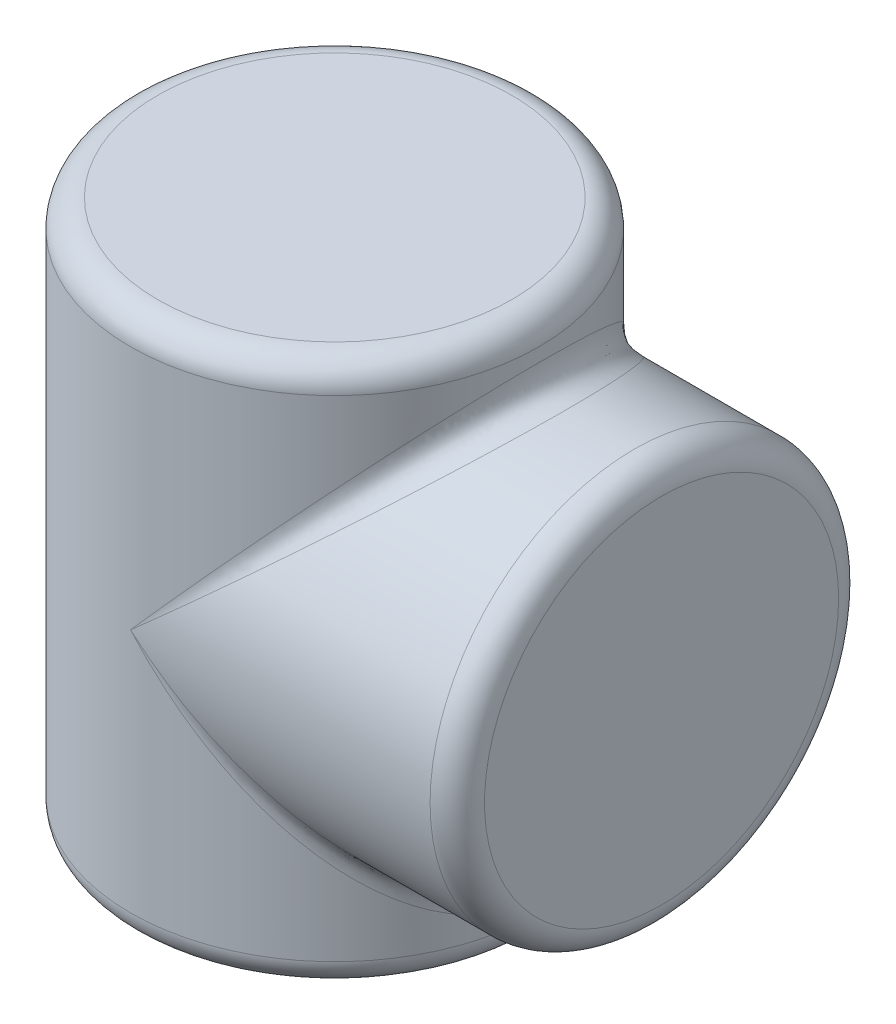
ISO-10303-21;
HEADER;
FILE_DESCRIPTION(('STEP AP214'),'2;1');
FILE_NAME('part.step','',(''),(''),'','','');
FILE_SCHEMA(('AUTOMOTIVE_DESIGN { 1 0 10303 214 1 1 1 1 }'));
ENDSEC;
DATA;
#1=APPLICATION_CONTEXT('core data for automotive mechanical design processes');
#2=APPLICATION_PROTOCOL_DEFINITION('international standard','automotive_design',2000,#1);
#3=PRODUCT_CONTEXT('',#1,'mechanical');
#4=PRODUCT('Part','Part','',(#3));
#5=PRODUCT_RELATED_PRODUCT_CATEGORY('part','',(#4));
#6=PRODUCT_DEFINITION_FORMATION('','',#4);
#7=PRODUCT_DEFINITION_CONTEXT('part definition',#1,'design');
#8=PRODUCT_DEFINITION('design','',#6,#7);
#9=PRODUCT_DEFINITION_SHAPE('','',#8);
#10=(LENGTH_UNIT() NAMED_UNIT(*) SI_UNIT(.MILLI.,.METRE.));
#11=(NAMED_UNIT(*) PLANE_ANGLE_UNIT() SI_UNIT($,.RADIAN.));
#12=(NAMED_UNIT(*) SI_UNIT($,.STERADIAN.) SOLID_ANGLE_UNIT());
#13=UNCERTAINTY_MEASURE_WITH_UNIT(LENGTH_MEASURE(1.E-05),#10,'distance_accuracy_value','');
#14=(GEOMETRIC_REPRESENTATION_CONTEXT(3) GLOBAL_UNCERTAINTY_ASSIGNED_CONTEXT((#13)) GLOBAL_UNIT_ASSIGNED_CONTEXT((#10,
#11,#12)) REPRESENTATION_CONTEXT('',''));
#15=CARTESIAN_POINT('',(0.,0.,0.));
#16=DIRECTION('',(0.,0.,1.));
#17=DIRECTION('',(1.,0.,0.));
#18=AXIS2_PLACEMENT_3D('',#15,#16,#17);
#19=CARTESIAN_POINT('',(0.,200.,0.));
#20=DIRECTION('',(0.,-1.,0.));
#21=DIRECTION('',(0.,0.,-1.));
#22=AXIS2_PLACEMENT_3D('',#19,#20,#21);
#23=CYLINDRICAL_SURFACE('',#22,75.);
#24=CARTESIAN_POINT('',(0.,10.,0.));
#25=DIRECTION('',(0.,1.,0.));
#26=DIRECTION('',(0.,0.,1.));
#27=AXIS2_PLACEMENT_3D('',#24,#25,#26);
#28=CIRCLE('',#27,75.);
#29=CARTESIAN_POINT('',(0.,10.,75.));
#30=VERTEX_POINT('',#29);
#31=EDGE_CURVE('E184',#30,#30,#28,.T.);
#32=ORIENTED_EDGE('',*,*,#31,.T.);
#33=EDGE_LOOP('',(#32));
#34=FACE_BOUND('',#33,.T.);
#35=CARTESIAN_POINT('',(0.,190.,0.));
#36=DIRECTION('',(0.,1.,0.));
#37=DIRECTION('',(0.,0.,1.));
#38=AXIS2_PLACEMENT_3D('',#35,#36,#37);
#39=CIRCLE('',#38,75.);
#40=CARTESIAN_POINT('',(0.,190.,75.));
#41=VERTEX_POINT('',#40);
#42=EDGE_CURVE('E181',#41,#41,#39,.F.);
#43=ORIENTED_EDGE('',*,*,#42,.T.);
#44=EDGE_LOOP('',(#43));
#45=FACE_BOUND('',#44,.T.);
#46=CARTESIAN_POINT('',(0.,100.,-75.));
#47=CARTESIAN_POINT('',(4.90873852134731,105.563236990907,-75.));
#48=CARTESIAN_POINT('',(14.7260745046688,116.68955110527,-74.0330709298438));
#49=CARTESIAN_POINT('',(28.8862763588966,132.737779873422,-69.7376279270002));
#50=CARTESIAN_POINT('',(41.9363646240357,147.527879907239,-62.7622069922342));
#51=CARTESIAN_POINT('',(53.3748700037823,160.49151933762,-53.3748696402081));
#52=CARTESIAN_POINT('',(62.7622068947814,171.130501147419,-41.9363659808802));
#53=CARTESIAN_POINT('',(69.7376279532376,179.035978347003,-28.8862712950921));
#54=CARTESIAN_POINT('',(74.0330709223475,183.904147045327,-14.7260934030413));
#55=CARTESIAN_POINT('',(75.4834645388263,185.547926477336,-1.33170286745593E-13));
#56=CARTESIAN_POINT('',(74.0330709223475,183.904147045327,14.7260934030414));
#57=CARTESIAN_POINT('',(69.7376279532375,179.035978347003,28.8862712950923));
#58=CARTESIAN_POINT('',(62.7622068947813,171.130501147419,41.9363659808803));
#59=CARTESIAN_POINT('',(53.3748700037825,160.49151933762,53.3748696402079));
#60=CARTESIAN_POINT('',(41.9363646240354,147.52787990724,62.7622069922343));
#61=CARTESIAN_POINT('',(28.8862763588967,132.737779873418,69.7376279270002));
#62=CARTESIAN_POINT('',(14.7260745046685,116.689551105284,74.0330709298439));
#63=CARTESIAN_POINT('',(4.90873852134728,105.563236990876,75.));
#64=CARTESIAN_POINT('',(0.,100.,75.));
#65=B_SPLINE_CURVE_WITH_KNOTS('',3,(#46,#47,#48,#49,#50,#51,#52,#53,#54,#55,#56,#57,#58,#59,#60,
#61,#62,#63,#64),.UNSPECIFIED.,.F.,.F.,(4,1,1,1,1,1,1,1,1,1,1,1,1,1,1,1,4),(1.5707963267949,
1.76714586764426,1.96349540849362,2.15984494934298,2.35619449019235,2.55254403104171,
2.74889357189107,2.94524311274043,3.14159265358979,3.33794219443915,3.53429173528852,
3.73064127613788,3.92699081698724,4.1233403578366,4.31968989868597,4.51603943953533,
4.71238898038469),.UNSPECIFIED.);
#66=CARTESIAN_POINT('',(0.,100.,75.));
#67=VERTEX_POINT('',#66);
#68=CARTESIAN_POINT('',(0.,100.,-75.));
#69=VERTEX_POINT('',#68);
#70=EDGE_CURVE('E63',#67,#69,#65,.F.);
#71=ORIENTED_EDGE('',*,*,#70,.T.);
#72=CARTESIAN_POINT('',(0.,100.,75.));
#73=CARTESIAN_POINT('',(4.90873852134731,94.4367630090934,75.));
#74=CARTESIAN_POINT('',(14.7260745046688,83.3104488947303,74.0330709298438));
#75=CARTESIAN_POINT('',(28.8862763588966,67.2622201265781,69.7376279270002));
#76=CARTESIAN_POINT('',(41.9363646240357,52.4721200927611,62.7622069922342));
#77=CARTESIAN_POINT('',(53.3748700037823,39.5084806623797,53.3748696402081));
#78=CARTESIAN_POINT('',(62.7622068947814,28.8694988525812,41.9363659808802));
#79=CARTESIAN_POINT('',(69.7376279532376,20.9640216529974,28.8862712950921));
#80=CARTESIAN_POINT('',(74.0330709223475,16.0958529546728,14.7260934030413));
#81=CARTESIAN_POINT('',(75.4834645388263,14.4520735226636,1.33170286745593E-13));
#82=CARTESIAN_POINT('',(74.0330709223475,16.0958529546729,-14.7260934030414));
#83=CARTESIAN_POINT('',(69.7376279532375,20.9640216529975,-28.8862712950923));
#84=CARTESIAN_POINT('',(62.7622068947813,28.8694988525813,-41.9363659808803));
#85=CARTESIAN_POINT('',(53.3748700037825,39.5084806623797,-53.3748696402079));
#86=CARTESIAN_POINT('',(41.9363646240354,52.4721200927604,-62.7622069922343));
#87=CARTESIAN_POINT('',(28.8862763588967,67.2622201265818,-69.7376279270002));
#88=CARTESIAN_POINT('',(14.7260745046685,83.3104488947164,-74.0330709298439));
#89=CARTESIAN_POINT('',(4.90873852134728,94.436763009124,-75.));
#90=CARTESIAN_POINT('',(0.,100.,-75.));
#91=B_SPLINE_CURVE_WITH_KNOTS('',3,(#72,#73,#74,#75,#76,#77,#78,#79,#80,#81,#82,#83,#84,#85,#86,
#87,#88,#89,#90),.UNSPECIFIED.,.F.,.F.,(4,1,1,1,1,1,1,1,1,1,1,1,1,1,1,1,4),(1.5707963267949,
1.76714586764426,1.96349540849362,2.15984494934298,2.35619449019235,2.55254403104171,
2.74889357189107,2.94524311274043,3.14159265358979,3.33794219443915,3.53429173528852,
3.73064127613788,3.92699081698724,4.1233403578366,4.31968989868597,4.51603943953533,
4.71238898038469),.UNSPECIFIED.);
#92=EDGE_CURVE('E57',#69,#67,#91,.F.);
#93=ORIENTED_EDGE('',*,*,#92,.T.);
#94=EDGE_LOOP('',(#71,#93));
#95=FACE_BOUND('',#94,.T.);
#96=ADVANCED_FACE('F43',(#34,#45,#95),#23,.T.);
#97=CARTESIAN_POINT('',(0.,200.,0.));
#98=DIRECTION('',(0.,1.,0.));
#99=DIRECTION('',(0.,0.,1.));
#100=AXIS2_PLACEMENT_3D('',#97,#98,#99);
#101=PLANE('',#100);
#102=CARTESIAN_POINT('',(0.,200.,0.));
#103=DIRECTION('',(0.,1.,0.));
#104=DIRECTION('',(0.,0.,1.));
#105=AXIS2_PLACEMENT_3D('',#102,#103,#104);
#106=CIRCLE('',#105,65.);
#107=CARTESIAN_POINT('',(0.,200.,65.));
#108=VERTEX_POINT('',#107);
#109=EDGE_CURVE('E12',#108,#108,#106,.T.);
#110=ORIENTED_EDGE('',*,*,#109,.T.);
#111=EDGE_LOOP('',(#110));
#112=FACE_BOUND('',#111,.T.);
#113=ADVANCED_FACE('F198',(#112),#101,.T.);
#114=CARTESIAN_POINT('',(0.,0.,0.));
#115=DIRECTION('',(0.,1.,0.));
#116=DIRECTION('',(0.,0.,1.));
#117=AXIS2_PLACEMENT_3D('',#114,#115,#116);
#118=PLANE('',#117);
#119=CARTESIAN_POINT('',(0.,0.,0.));
#120=DIRECTION('',(0.,1.,0.));
#121=DIRECTION('',(0.,0.,1.));
#122=AXIS2_PLACEMENT_3D('',#119,#120,#121);
#123=CIRCLE('',#122,65.);
#124=CARTESIAN_POINT('',(0.,0.,65.));
#125=VERTEX_POINT('',#124);
#126=EDGE_CURVE('E51',#125,#125,#123,.F.);
#127=ORIENTED_EDGE('',*,*,#126,.T.);
#128=EDGE_LOOP('',(#127));
#129=FACE_BOUND('',#128,.T.);
#130=ADVANCED_FACE('F189',(#129),#118,.F.);
#131=CARTESIAN_POINT('',(120.,100.,0.));
#132=DIRECTION('',(-1.,0.,0.));
#133=DIRECTION('',(0.,0.,1.));
#134=AXIS2_PLACEMENT_3D('',#131,#132,#133);
#135=CYLINDRICAL_SURFACE('',#134,75.);
#136=CARTESIAN_POINT('',(110.,100.,0.));
#137=DIRECTION('',(1.,0.,0.));
#138=DIRECTION('',(0.,0.,-1.));
#139=AXIS2_PLACEMENT_3D('',#136,#137,#138);
#140=CIRCLE('',#139,75.);
#141=CARTESIAN_POINT('',(110.,100.,-75.));
#142=VERTEX_POINT('',#141);
#143=EDGE_CURVE('E178',#142,#142,#140,.F.);
#144=ORIENTED_EDGE('',*,*,#143,.T.);
#145=EDGE_LOOP('',(#144));
#146=FACE_BOUND('',#145,.T.);
#147=CARTESIAN_POINT('',(0.,100.,75.));
#148=CARTESIAN_POINT('',(5.56323699086026,104.908738521387,75.));
#149=CARTESIAN_POINT('',(16.689551105291,114.72607450465,74.0330709298439));
#150=CARTESIAN_POINT('',(32.7377798734162,128.886276358902,69.7376279270002));
#151=CARTESIAN_POINT('',(47.5278799072401,141.936364624034,62.7622069922343));
#152=CARTESIAN_POINT('',(60.4915193376202,153.374870003783,53.3748696402079));
#153=CARTESIAN_POINT('',(71.1305011474187,162.762206894781,41.9363659808803));
#154=CARTESIAN_POINT('',(79.0359783470025,169.737627953238,28.8862712950923));
#155=CARTESIAN_POINT('',(83.9041470453271,174.033070922348,14.7260934030414));
#156=CARTESIAN_POINT('',(85.5479264773365,175.483464538826,-1.31078606849065E-13));
#157=CARTESIAN_POINT('',(83.9041470453272,174.033070922347,-14.7260934030412));
#158=CARTESIAN_POINT('',(79.0359783470026,169.737627953238,-28.8862712950921));
#159=CARTESIAN_POINT('',(71.1305011474189,162.762206894781,-41.9363659808802));
#160=CARTESIAN_POINT('',(60.4915193376199,153.374870003783,-53.3748696402081));
#161=CARTESIAN_POINT('',(47.5278799072404,141.936364624032,-62.7622069922342));
#162=CARTESIAN_POINT('',(32.7377798734162,128.88627635891,-69.7376279270002));
#163=CARTESIAN_POINT('',(16.6895511052913,114.72607450462,-74.0330709298438));
#164=CARTESIAN_POINT('',(5.56323699086028,104.908738521452,-75.));
#165=CARTESIAN_POINT('',(0.,100.,-75.));
#166=B_SPLINE_CURVE_WITH_KNOTS('',3,(#147,#148,#149,#150,#151,#152,#153,#154,#155,#156,#157,
#158,#159,#160,#161,#162,#163,#164,#165),.UNSPECIFIED.,.F.,.F.,(4,1,1,1,1,1,1,1,1,1,1,1,1,1,1,1,
4),(1.5707963267949,1.76714586764426,1.96349540849362,2.15984494934298,2.35619449019234,
2.55254403104171,2.74889357189107,2.94524311274043,3.14159265358979,3.33794219443915,
3.53429173528852,3.73064127613788,3.92699081698724,4.1233403578366,4.31968989868597,
4.51603943953533,4.71238898038469),.UNSPECIFIED.);
#167=EDGE_CURVE('E67',#69,#67,#166,.F.);
#168=ORIENTED_EDGE('',*,*,#167,.T.);
#169=CARTESIAN_POINT('',(0.,100.,-75.));
#170=CARTESIAN_POINT('',(5.56323699086026,95.0912614786131,-75.));
#171=CARTESIAN_POINT('',(16.689551105291,85.2739254953499,-74.0330709298439));
#172=CARTESIAN_POINT('',(32.7377798734162,71.1137236410984,-69.7376279270002));
#173=CARTESIAN_POINT('',(47.5278799072401,58.0636353759659,-62.7622069922343));
#174=CARTESIAN_POINT('',(60.4915193376202,46.6251299962172,-53.3748696402079));
#175=CARTESIAN_POINT('',(71.1305011474188,37.2377931052188,-41.9363659808803));
#176=CARTESIAN_POINT('',(79.0359783470025,30.2623720467625,-28.8862712950923));
#177=CARTESIAN_POINT('',(83.9041470453271,25.9669290776525,-14.7260934030414));
#178=CARTESIAN_POINT('',(85.5479264773365,24.5165354611737,1.33170286745593E-13));
#179=CARTESIAN_POINT('',(83.9041470453272,25.9669290776525,14.7260934030413));
#180=CARTESIAN_POINT('',(79.0359783470026,30.2623720467623,28.8862712950921));
#181=CARTESIAN_POINT('',(71.130501147419,37.2377931052188,41.9363659808802));
#182=CARTESIAN_POINT('',(60.4915193376199,46.6251299962168,53.3748696402081));
#183=CARTESIAN_POINT('',(47.5278799072404,58.0636353759678,62.7622069922342));
#184=CARTESIAN_POINT('',(32.7377798734162,71.1137236410903,69.7376279270002));
#185=CARTESIAN_POINT('',(16.6895511052912,85.27392549538,74.0330709298438));
#186=CARTESIAN_POINT('',(5.56323699086028,95.0912614785476,75.));
#187=CARTESIAN_POINT('',(0.,100.,75.));
#188=B_SPLINE_CURVE_WITH_KNOTS('',3,(#169,#170,#171,#172,#173,#174,#175,#176,#177,#178,#179,
#180,#181,#182,#183,#184,#185,#186,#187),.UNSPECIFIED.,.F.,.F.,(4,1,1,1,1,1,1,1,1,1,1,1,1,1,1,1,
4),(1.5707963267949,1.76714586764426,1.96349540849362,2.15984494934298,2.35619449019234,
2.55254403104171,2.74889357189107,2.94524311274043,3.14159265358979,3.33794219443915,
3.53429173528852,3.73064127613788,3.92699081698724,4.1233403578366,4.31968989868597,
4.51603943953533,4.71238898038469),.UNSPECIFIED.);
#189=EDGE_CURVE('E72',#67,#69,#188,.F.);
#190=ORIENTED_EDGE('',*,*,#189,.T.);
#191=EDGE_LOOP('',(#168,#190));
#192=FACE_BOUND('',#191,.T.);
#193=ADVANCED_FACE('F81',(#146,#192),#135,.T.);
#194=CARTESIAN_POINT('',(120.,100.,0.));
#195=DIRECTION('',(1.,0.,0.));
#196=DIRECTION('',(0.,0.,-1.));
#197=AXIS2_PLACEMENT_3D('',#194,#195,#196);
#198=PLANE('',#197);
#199=CARTESIAN_POINT('',(120.,100.,0.));
#200=DIRECTION('',(1.,0.,0.));
#201=DIRECTION('',(0.,0.,-1.));
#202=AXIS2_PLACEMENT_3D('',#199,#200,#201);
#203=CIRCLE('',#202,65.);
#204=CARTESIAN_POINT('',(120.,100.,-65.));
#205=VERTEX_POINT('',#204);
#206=EDGE_CURVE('E76',#205,#205,#203,.T.);
#207=ORIENTED_EDGE('',*,*,#206,.T.);
#208=EDGE_LOOP('',(#207));
#209=FACE_BOUND('',#208,.T.);
#210=ADVANCED_FACE('F107',(#209),#198,.T.);
#211=CARTESIAN_POINT('',(0.,100.,-75.));
#212=CARTESIAN_POINT('',(4.90873852134728,94.436763009124,-75.));
#213=CARTESIAN_POINT('',(14.7260745046685,83.3104488947164,-74.0330709298439));
#214=CARTESIAN_POINT('',(28.8862763588967,67.2622201265818,-69.7376279270002));
#215=CARTESIAN_POINT('',(41.9363646240354,52.4721200927604,-62.7622069922343));
#216=CARTESIAN_POINT('',(53.3748700037825,39.5084806623797,-53.3748696402079));
#217=CARTESIAN_POINT('',(62.7622068947813,28.8694988525813,-41.9363659808803));
#218=CARTESIAN_POINT('',(69.7376279532375,20.9640216529975,-28.8862712950923));
#219=CARTESIAN_POINT('',(74.0330709223475,16.0958529546729,-14.7260934030414));
#220=CARTESIAN_POINT('',(75.4834645388263,14.4520735226636,1.33170286745593E-13));
#221=CARTESIAN_POINT('',(74.0330709223475,16.0958529546728,14.7260934030413));
#222=CARTESIAN_POINT('',(69.7376279532376,20.9640216529974,28.8862712950921));
#223=CARTESIAN_POINT('',(62.7622068947814,28.8694988525812,41.9363659808802));
#224=CARTESIAN_POINT('',(53.3748700037823,39.5084806623797,53.3748696402081));
#225=CARTESIAN_POINT('',(41.9363646240357,52.4721200927611,62.7622069922342));
#226=CARTESIAN_POINT('',(28.8862763588966,67.2622201265781,69.7376279270002));
#227=CARTESIAN_POINT('',(14.7260745046688,83.3104488947303,74.0330709298438));
#228=CARTESIAN_POINT('',(4.90873852134731,94.4367630090934,75.));
#229=CARTESIAN_POINT('',(0.,100.,75.));
#230=CARTESIAN_POINT('',(0.,100.,-75.));
#231=CARTESIAN_POINT('',(4.96873160478422,94.4967560925909,-75.));
#232=CARTESIAN_POINT('',(14.9060552691991,83.4904422169201,-74.0091456317852));
#233=CARTESIAN_POINT('',(29.2157524071403,67.6331728543244,-69.6126281602308));
#234=CARTESIAN_POINT('',(42.3567011669906,53.0556521382544,-62.4915779962443));
#235=CARTESIAN_POINT('',(53.8054091913607,40.3347379469237,-52.95111985091));
#236=CARTESIAN_POINT('',(63.1138839975664,29.9692784610169,-41.4078237380091));
#237=CARTESIAN_POINT('',(69.9403359478846,22.3477528348586,-28.3711807592621));
#238=CARTESIAN_POINT('',(74.0792454421043,17.7145565059867,-14.3969774467668));
#239=CARTESIAN_POINT('',(75.4603772790688,16.1656925201367,1.3038138021689E-13));
#240=CARTESIAN_POINT('',(74.0792454416207,17.7145565055031,14.3969774467666));
#241=CARTESIAN_POINT('',(69.9403359498192,22.347752836793,28.3711807592619));
#242=CARTESIAN_POINT('',(63.1138839903122,29.9692784537624,41.407823738009));
#243=CARTESIAN_POINT('',(53.8054092184431,40.3347379740069,52.9511198509101));
#244=CARTESIAN_POINT('',(42.3567010659144,53.0556520371768,62.4915779962442));
#245=CARTESIAN_POINT('',(29.2157527843635,67.6331732315512,69.6126281602308));
#246=CARTESIAN_POINT('',(14.9060538613829,83.49044080909,74.0091456317851));
#247=CARTESIAN_POINT('',(4.96873463820719,94.4967591260427,75.));
#248=CARTESIAN_POINT('',(0.,100.,75.));
#249=CARTESIAN_POINT('',(0.,100.,-75.));
#250=CARTESIAN_POINT('',(5.02917044387289,94.557194931664,-75.));
#251=CARTESIAN_POINT('',(15.0873716449633,83.6717723507031,-73.984672353664));
#252=CARTESIAN_POINT('',(29.547179869741,68.0070063561997,-69.484852996013));
#253=CARTESIAN_POINT('',(42.7782937742931,53.6438742602515,-62.2153305416005));
#254=CARTESIAN_POINT('',(54.2350833607353,41.1674378585455,-52.5197342949147));
#255=CARTESIAN_POINT('',(63.4621412849345,31.0762257329873,-40.8721909483484));
#256=CARTESIAN_POINT('',(70.1389795538125,23.7369674936081,-27.8525283759204));
#257=CARTESIAN_POINT('',(74.1239853979346,19.334812491051,-14.0677572733003));
#258=CARTESIAN_POINT('',(75.4380073012644,17.8785353007246,1.35959193274297E-13));
#259=CARTESIAN_POINT('',(74.1239853970078,19.3348124901242,14.0677572733));
#260=CARTESIAN_POINT('',(70.1389795575198,23.7369674973153,27.8525283759203));
#261=CARTESIAN_POINT('',(63.4621412710323,31.0762257190847,40.8721909483477));
#262=CARTESIAN_POINT('',(54.235083412637,41.1674379104484,52.5197342949168));
#263=CARTESIAN_POINT('',(42.7782935805875,53.6438740665431,62.2153305415931));
#264=CARTESIAN_POINT('',(29.5471805926624,68.0070070791296,69.4848529960402));
#265=CARTESIAN_POINT('',(15.0873689469836,83.6717696526914,73.9846723535626));
#266=CARTESIAN_POINT('',(5.02917625721192,94.5572007450708,75.0000000002184));
#267=CARTESIAN_POINT('',(0.,100.,75.));
#268=CARTESIAN_POINT('',(0.,100.,-75.));
#269=CARTESIAN_POINT('',(5.1670525889094,94.6950770765367,-74.9999999998362));
#270=CARTESIAN_POINT('',(15.5009754564012,84.0854022213369,-73.9404336636637));
#271=CARTESIAN_POINT('',(30.324137787012,68.8605919340949,-69.2539966185632));
#272=CARTESIAN_POINT('',(43.8204998326553,54.9868892498366,-61.7167326773675));
#273=CARTESIAN_POINT('',(55.4044594550508,43.0630476883416,-51.7426456175473));
#274=CARTESIAN_POINT('',(64.6012361861491,33.578219467653,-39.9105008154546));
#275=CARTESIAN_POINT('',(71.1156799165091,26.8429691043534,-26.9257305644086));
#276=CARTESIAN_POINT('',(74.9019360764769,22.9176632184677,-13.4823380086595));
#277=CARTESIAN_POINT('',(76.1244107592741,21.6477701085356,1.23409113895131E-13));
#278=CARTESIAN_POINT('',(74.901936076592,22.9176632185826,13.4823380086594));
#279=CARTESIAN_POINT('',(71.1156799160492,26.8429691038935,26.9257305644084));
#280=CARTESIAN_POINT('',(64.6012361878742,33.5782194693773,39.9105008154545));
#281=CARTESIAN_POINT('',(55.4044594486107,43.0630476819038,51.7426456175475));
#282=CARTESIAN_POINT('',(43.8204998566898,54.9868892738641,61.7167326773673));
#283=CARTESIAN_POINT('',(30.3241376973146,68.8605918444219,69.2539966185632));
#284=CARTESIAN_POINT('',(15.5009757911568,84.0854025560011,73.9404336636636));
#285=CARTESIAN_POINT('',(5.16705186761196,94.6950763554349,74.9999999998362));
#286=CARTESIAN_POINT('',(0.,100.,75.));
#287=CARTESIAN_POINT('',(0.,100.,-75.));
#288=CARTESIAN_POINT('',(5.30493071140957,94.8329551993632,-74.9999999998362));
#289=CARTESIAN_POINT('',(15.9145941642647,84.4990209290489,-73.9404336636637));
#290=CARTESIAN_POINT('',(31.1394090343802,69.6758631815037,-69.2539966185632));
#291=CARTESIAN_POINT('',(45.0131104906611,56.1794999078315,-61.7167326773675));
#292=CARTESIAN_POINT('',(56.9369523811926,44.5955406144863,-51.7426456175473));
#293=CARTESIAN_POINT('',(66.4217805137129,35.3987637952161,-39.9105008154546));
#294=CARTESIAN_POINT('',(73.1570309006489,28.8843200884934,-26.9257305644086));
#295=CARTESIAN_POINT('',(77.0823367801574,25.098063922148,-13.4823380086595));
#296=CARTESIAN_POINT('',(78.3522298919619,23.8755892412236,1.23409113895131E-13));
#297=CARTESIAN_POINT('',(77.082336780802,25.0980639227927,13.4823380086594));
#298=CARTESIAN_POINT('',(73.1570308980704,28.8843200859147,26.9257305644084));
#299=CARTESIAN_POINT('',(66.4217805233828,35.3987638048861,39.9105008154545));
#300=CARTESIAN_POINT('',(56.9369523450922,44.5955405783848,51.7426456175475));
#301=CARTESIAN_POINT('',(45.013110625392,56.179500042568,61.7167326773673));
#302=CARTESIAN_POINT('',(31.1394085315579,69.6758626786584,69.2539966185632));
#303=CARTESIAN_POINT('',(15.9145960408238,84.4990228056933,73.9404336636636));
#304=CARTESIAN_POINT('',(5.30492666798703,94.8329511557559,74.9999999998362));
#305=CARTESIAN_POINT('',(0.,100.,75.));
#306=CARTESIAN_POINT('',(0.,100.,-75.));
#307=CARTESIAN_POINT('',(5.44280481182377,94.9708292993792,-75.));
#308=CARTESIAN_POINT('',(16.3282277683447,84.9126284741938,-73.984672353664));
#309=CARTESIAN_POINT('',(31.9929936119016,70.452820098331,-69.484852996013));
#310=CARTESIAN_POINT('',(46.3561257482956,57.2217062342619,-62.2153305416005));
#311=CARTESIAN_POINT('',(58.8325621391646,45.7649166369728,-52.5197342949147));
#312=CARTESIAN_POINT('',(68.9237742676251,36.5378587156785,-40.8721909483484));
#313=CARTESIAN_POINT('',(76.2630325062321,29.8610204460276,-27.8525283759204));
#314=CARTESIAN_POINT('',(80.6651875089757,25.8760146020922,-14.0677572733003));
#315=CARTESIAN_POINT('',(82.1214646993282,24.5619926987884,1.35959193274297E-13));
#316=CARTESIAN_POINT('',(80.665187509638,25.8760146027544,14.0677572733));
#317=CARTESIAN_POINT('',(76.2630325035834,29.8610204433789,27.8525283759203));
#318=CARTESIAN_POINT('',(68.9237742775582,36.5378587256107,40.8721909483477));
#319=CARTESIAN_POINT('',(58.8325621020816,45.7649165998925,52.5197342949168));
#320=CARTESIAN_POINT('',(46.3561258866941,57.2217063726514,62.2153305415931));
#321=CARTESIAN_POINT('',(31.9929930953915,70.4528195818527,69.4848529960402));
#322=CARTESIAN_POINT('',(16.3282296959869,84.9126304017173,73.9846723535626));
#323=CARTESIAN_POINT('',(5.44280065833244,94.9708251461428,75.0000000002184));
#324=CARTESIAN_POINT('',(0.,100.,75.));
#325=CARTESIAN_POINT('',(0.,100.,-75.));
#326=CARTESIAN_POINT('',(5.50324372513603,95.0312682128073,-75.));
#327=CARTESIAN_POINT('',(16.5095578676731,85.093944815457,-74.0091456317852));
#328=CARTESIAN_POINT('',(32.366827123009,70.7842475701762,-69.6126281602308));
#329=CARTESIAN_POINT('',(46.944347867819,57.6432988390873,-62.4915779962443));
#330=CARTESIAN_POINT('',(59.6652620514491,46.1945908070109,-52.95111985091));
#331=CARTESIAN_POINT('',(70.0307215394186,36.8861160028694,-41.4078237380091));
#332=CARTESIAN_POINT('',(77.6522471650269,30.0596640520008,-28.3711807592621));
#333=CARTESIAN_POINT('',(82.2854434940359,25.9207545579183,-14.3969774467668));
#334=CARTESIAN_POINT('',(83.8343074798874,24.5396227209554,1.3038138021689E-13));
#335=CARTESIAN_POINT('',(82.2854434943778,25.9207545582602,14.3969774467666));
#336=CARTESIAN_POINT('',(77.6522471636595,30.0596640506333,28.3711807592619));
#337=CARTESIAN_POINT('',(70.0307215445468,36.8861160079972,41.407823738009));
#338=CARTESIAN_POINT('',(59.6652620323041,46.1945907878667,52.9511198509101));
#339=CARTESIAN_POINT('',(46.9443479392699,57.6432989105369,62.4915779962442));
#340=CARTESIAN_POINT('',(32.3668268563513,70.7842473035216,69.6126281602308));
#341=CARTESIAN_POINT('',(16.5095588628534,85.0939458106256,74.0091456317851));
#342=CARTESIAN_POINT('',(5.50324158082115,95.0312660685162,75.));
#343=CARTESIAN_POINT('',(0.,100.,75.));
#344=CARTESIAN_POINT('',(0.,100.,-75.));
#345=CARTESIAN_POINT('',(5.56323699086026,95.0912614786131,-75.));
#346=CARTESIAN_POINT('',(16.689551105291,85.2739254953499,-74.0330709298439));
#347=CARTESIAN_POINT('',(32.7377798734162,71.1137236410984,-69.7376279270002));
#348=CARTESIAN_POINT('',(47.5278799072401,58.0636353759659,-62.7622069922343));
#349=CARTESIAN_POINT('',(60.4915193376202,46.6251299962172,-53.3748696402079));
#350=CARTESIAN_POINT('',(71.1305011474188,37.2377931052188,-41.9363659808803));
#351=CARTESIAN_POINT('',(79.0359783470025,30.2623720467625,-28.8862712950923));
#352=CARTESIAN_POINT('',(83.9041470453271,25.9669290776525,-14.7260934030414));
#353=CARTESIAN_POINT('',(85.5479264773365,24.5165354611737,1.33170286745593E-13));
#354=CARTESIAN_POINT('',(83.9041470453272,25.9669290776525,14.7260934030413));
#355=CARTESIAN_POINT('',(79.0359783470026,30.2623720467623,28.8862712950921));
#356=CARTESIAN_POINT('',(71.130501147419,37.2377931052188,41.9363659808802));
#357=CARTESIAN_POINT('',(60.4915193376199,46.6251299962168,53.3748696402081));
#358=CARTESIAN_POINT('',(47.5278799072404,58.0636353759678,62.7622069922342));
#359=CARTESIAN_POINT('',(32.7377798734162,71.1137236410903,69.7376279270002));
#360=CARTESIAN_POINT('',(16.6895511052913,85.27392549538,74.0330709298438));
#361=CARTESIAN_POINT('',(5.56323699086028,95.0912614785476,75.));
#362=CARTESIAN_POINT('',(0.,100.,75.));
#363=B_SPLINE_SURFACE_WITH_KNOTS('',5,3,((#211,#212,#213,#214,#215,#216,#217,#218,#219,#220,
#221,#222,#223,#224,#225,#226,#227,#228,#229),(#230,#231,#232,#233,#234,#235,#236,#237,#238,
#239,#240,#241,#242,#243,#244,#245,#246,#247,#248),(#249,#250,#251,#252,#253,#254,#255,#256,
#257,#258,#259,#260,#261,#262,#263,#264,#265,#266,#267),(#268,#269,#270,#271,#272,#273,#274,
#275,#276,#277,#278,#279,#280,#281,#282,#283,#284,#285,#286),(#287,#288,#289,#290,#291,#292,
#293,#294,#295,#296,#297,#298,#299,#300,#301,#302,#303,#304,#305),(#306,#307,#308,#309,#310,
#311,#312,#313,#314,#315,#316,#317,#318,#319,#320,#321,#322,#323,#324),(#325,#326,#327,#328,
#329,#330,#331,#332,#333,#334,#335,#336,#337,#338,#339,#340,#341,#342,#343),(#344,#345,#346,
#347,#348,#349,#350,#351,#352,#353,#354,#355,#356,#357,#358,#359,#360,#361,#362)),.UNSPECIFIED.,
.F.,.F.,.F.,(6,2,6),(4,1,1,1,1,1,1,1,1,1,1,1,1,1,1,1,4),(0.,0.5,1.),(1.5707963267949,
1.76714586764426,1.96349540849362,2.15984494934298,2.35619449019234,2.55254403104171,
2.74889357189107,2.94524311274043,3.14159265358979,3.33794219443915,3.53429173528852,
3.73064127613788,3.92699081698724,4.1233403578366,4.31968989868597,4.51603943953533,
4.71238898038469),.UNSPECIFIED.);
#364=ORIENTED_EDGE('',*,*,#189,.F.);
#365=ORIENTED_EDGE('',*,*,#92,.F.);
#366=EDGE_LOOP('',(#364,#365));
#367=FACE_BOUND('',#366,.T.);
#368=ADVANCED_FACE('F85',(#367),#363,.T.);
#369=CARTESIAN_POINT('',(0.,100.,75.));
#370=CARTESIAN_POINT('',(4.90873852134728,105.563236990876,75.));
#371=CARTESIAN_POINT('',(14.7260745046685,116.689551105284,74.0330709298439));
#372=CARTESIAN_POINT('',(28.8862763588967,132.737779873418,69.7376279270002));
#373=CARTESIAN_POINT('',(41.9363646240354,147.52787990724,62.7622069922343));
#374=CARTESIAN_POINT('',(53.3748700037825,160.49151933762,53.3748696402079));
#375=CARTESIAN_POINT('',(62.7622068947813,171.130501147419,41.9363659808803));
#376=CARTESIAN_POINT('',(69.7376279532375,179.035978347003,28.8862712950923));
#377=CARTESIAN_POINT('',(74.0330709223475,183.904147045327,14.7260934030414));
#378=CARTESIAN_POINT('',(75.4834645388263,185.547926477336,-1.33170286745593E-13));
#379=CARTESIAN_POINT('',(74.0330709223475,183.904147045327,-14.7260934030413));
#380=CARTESIAN_POINT('',(69.7376279532376,179.035978347003,-28.8862712950921));
#381=CARTESIAN_POINT('',(62.7622068947814,171.130501147419,-41.9363659808802));
#382=CARTESIAN_POINT('',(53.3748700037823,160.49151933762,-53.3748696402081));
#383=CARTESIAN_POINT('',(41.9363646240357,147.527879907239,-62.7622069922342));
#384=CARTESIAN_POINT('',(28.8862763588966,132.737779873422,-69.7376279270002));
#385=CARTESIAN_POINT('',(14.7260745046688,116.68955110527,-74.0330709298438));
#386=CARTESIAN_POINT('',(4.90873852134731,105.563236990907,-75.));
#387=CARTESIAN_POINT('',(0.,100.,-75.));
#388=CARTESIAN_POINT('',(0.,100.,75.));
#389=CARTESIAN_POINT('',(4.96873160478376,105.503243907409,75.));
#390=CARTESIAN_POINT('',(14.9060552691994,116.50955778308,74.0091456317852));
#391=CARTESIAN_POINT('',(29.2157524071402,132.366827145676,69.6126281602308));
#392=CARTESIAN_POINT('',(42.3567011669906,146.944347861746,62.4915779962443));
#393=CARTESIAN_POINT('',(53.8054091913607,159.665262053076,52.95111985091));
#394=CARTESIAN_POINT('',(63.1138839975664,170.030721538983,41.4078237380091));
#395=CARTESIAN_POINT('',(69.9403359478846,177.652247165142,28.3711807592621));
#396=CARTESIAN_POINT('',(74.0792454421043,182.285443494013,14.3969774467668));
#397=CARTESIAN_POINT('',(75.4603772790688,183.834307479863,-1.29684153584714E-13));
#398=CARTESIAN_POINT('',(74.0792454416207,182.285443494497,-14.3969774467666));
#399=CARTESIAN_POINT('',(69.9403359498192,177.652247163207,-28.3711807592619));
#400=CARTESIAN_POINT('',(63.1138839903122,170.030721546238,-41.407823738009));
#401=CARTESIAN_POINT('',(53.8054092184431,159.665262025993,-52.9511198509101));
#402=CARTESIAN_POINT('',(42.3567010659144,146.944347962823,-62.4915779962442));
#403=CARTESIAN_POINT('',(29.2157527843635,132.366826768449,-69.6126281602308));
#404=CARTESIAN_POINT('',(14.9060538613829,116.50955919091,-74.0091456317851));
#405=CARTESIAN_POINT('',(4.96873463820719,105.503240873957,-75.));
#406=CARTESIAN_POINT('',(0.,100.,-75.));
#407=CARTESIAN_POINT('',(0.,100.,75.));
#408=CARTESIAN_POINT('',(5.02917044386425,105.442805068336,75.));
#409=CARTESIAN_POINT('',(15.0873716449673,116.328227649297,73.984672353664));
#410=CARTESIAN_POINT('',(29.5471798697399,131.9929936438,69.484852996013));
#411=CARTESIAN_POINT('',(42.7782937742934,146.356125739748,62.2153305416005));
#412=CARTESIAN_POINT('',(54.2350833607352,158.832562141455,52.5197342949147));
#413=CARTESIAN_POINT('',(63.4621412849345,168.923774267013,40.8721909483484));
#414=CARTESIAN_POINT('',(70.1389795538125,176.263032506392,27.8525283759204));
#415=CARTESIAN_POINT('',(74.1239853979346,180.665187508949,14.0677572733003));
#416=CARTESIAN_POINT('',(75.4380073012644,182.121464699275,-1.36656419906472E-13));
#417=CARTESIAN_POINT('',(74.1239853970078,180.665187509876,-14.0677572733));
#418=CARTESIAN_POINT('',(70.1389795575198,176.263032502685,-27.8525283759203));
#419=CARTESIAN_POINT('',(63.4621412710323,168.923774280915,-40.8721909483477));
#420=CARTESIAN_POINT('',(54.235083412637,158.832562089552,-52.5197342949168));
#421=CARTESIAN_POINT('',(42.7782935805875,146.356125933457,-62.2153305415931));
#422=CARTESIAN_POINT('',(29.5471805926624,131.99299292087,-69.4848529960402));
#423=CARTESIAN_POINT('',(15.0873689469836,116.328230347309,-73.9846723535626));
#424=CARTESIAN_POINT('',(5.02917625721192,105.442799254929,-75.0000000002184));
#425=CARTESIAN_POINT('',(0.,100.,-75.));
#426=CARTESIAN_POINT('',(0.,100.,75.));
#427=CARTESIAN_POINT('',(5.16705258891228,105.304922923409,74.9999999998362));
#428=CARTESIAN_POINT('',(15.5009754563999,115.914597778688,73.9404336636637));
#429=CARTESIAN_POINT('',(30.3241377870124,131.139408065898,69.2539966185632));
#430=CARTESIAN_POINT('',(43.8204998326552,145.013110750165,61.7167326773675));
#431=CARTESIAN_POINT('',(55.4044594550508,156.936952311658,51.7426456175473));
#432=CARTESIAN_POINT('',(64.601236186149,166.421780532347,39.9105008154546));
#433=CARTESIAN_POINT('',(71.1156799165091,173.157030895647,26.9257305644087));
#434=CARTESIAN_POINT('',(74.9019360764769,177.082336781532,13.4823380086595));
#435=CARTESIAN_POINT('',(76.124410759274,178.352229891464,-1.22014660630779E-13));
#436=CARTESIAN_POINT('',(74.9019360765919,177.082336781417,-13.4823380086594));
#437=CARTESIAN_POINT('',(71.1156799160492,173.157030896107,-26.9257305644084));
#438=CARTESIAN_POINT('',(64.6012361878741,166.421780530623,-39.9105008154544));
#439=CARTESIAN_POINT('',(55.4044594486107,156.936952318096,-51.7426456175475));
#440=CARTESIAN_POINT('',(43.8204998566898,145.013110726136,-61.7167326773673));
#441=CARTESIAN_POINT('',(30.3241376973146,131.139408155578,-69.2539966185632));
#442=CARTESIAN_POINT('',(15.5009757911568,115.914597443999,-73.9404336636636));
#443=CARTESIAN_POINT('',(5.16705186761196,105.304923644565,-74.9999999998362));
#444=CARTESIAN_POINT('',(0.,100.,-75.));
#445=CARTESIAN_POINT('',(0.,100.,75.));
#446=CARTESIAN_POINT('',(5.30493071141795,105.167044800582,74.9999999998362));
#447=CARTESIAN_POINT('',(15.9145941642608,115.500979070976,73.9404336636637));
#448=CARTESIAN_POINT('',(31.1394090343813,130.324136818489,69.2539966185632));
#449=CARTESIAN_POINT('',(45.0131104906608,143.82050009217,61.7167326773675));
#450=CARTESIAN_POINT('',(56.9369523811926,155.404459385513,51.7426456175473));
#451=CARTESIAN_POINT('',(66.421780513713,164.601236204784,39.9105008154546));
#452=CARTESIAN_POINT('',(73.1570309006489,171.115679911507,26.9257305644086));
#453=CARTESIAN_POINT('',(77.0823367801574,174.901936077852,13.4823380086595));
#454=CARTESIAN_POINT('',(78.3522298919619,176.124410758776,-1.24106340527307E-13));
#455=CARTESIAN_POINT('',(77.082336780802,174.901936077207,-13.4823380086594));
#456=CARTESIAN_POINT('',(73.1570308980704,171.115679914085,-26.9257305644085));
#457=CARTESIAN_POINT('',(66.4217805233827,164.601236195114,-39.9105008154544));
#458=CARTESIAN_POINT('',(56.9369523450922,155.404459421615,-51.7426456175475));
#459=CARTESIAN_POINT('',(45.013110625392,143.820499957432,-61.7167326773673));
#460=CARTESIAN_POINT('',(31.1394085315579,130.324137321342,-69.2539966185632));
#461=CARTESIAN_POINT('',(15.9145960408238,115.500977194307,-73.9404336636636));
#462=CARTESIAN_POINT('',(5.30492666798703,105.167048844244,-74.9999999998362));
#463=CARTESIAN_POINT('',(0.,100.,-75.));
#464=CARTESIAN_POINT('',(0.,100.,75.));
#465=CARTESIAN_POINT('',(5.44280481179863,105.029170700621,75.));
#466=CARTESIAN_POINT('',(16.3282277683564,115.087371525806,73.984672353664));
#467=CARTESIAN_POINT('',(31.9929936118985,129.547179901669,69.484852996013));
#468=CARTESIAN_POINT('',(46.3561257482965,142.778293765738,62.2153305416005));
#469=CARTESIAN_POINT('',(58.8325621391644,154.235083363027,52.5197342949147));
#470=CARTESIAN_POINT('',(68.9237742676252,163.462141284322,40.8721909483484));
#471=CARTESIAN_POINT('',(76.2630325062321,170.138979553973,27.8525283759204));
#472=CARTESIAN_POINT('',(80.6651875089757,174.123985397908,14.0677572733003));
#473=CARTESIAN_POINT('',(82.1214646993282,175.438007301212,-1.33867513377769E-13));
#474=CARTESIAN_POINT('',(80.665187509638,174.123985397246,-14.0677572733001));
#475=CARTESIAN_POINT('',(76.2630325035834,170.138979556621,-27.8525283759203));
#476=CARTESIAN_POINT('',(68.9237742775581,163.462141274389,-40.8721909483477));
#477=CARTESIAN_POINT('',(58.8325621020816,154.235083400108,-52.5197342949168));
#478=CARTESIAN_POINT('',(46.3561258866941,142.778293627349,-62.2153305415931));
#479=CARTESIAN_POINT('',(31.9929930953915,129.547180418147,-69.4848529960402));
#480=CARTESIAN_POINT('',(16.3282296959869,115.087369598283,-73.9846723535626));
#481=CARTESIAN_POINT('',(5.44280065833244,105.029174853857,-75.0000000002184));
#482=CARTESIAN_POINT('',(0.,100.,-75.));
#483=CARTESIAN_POINT('',(0.,100.,75.));
#484=CARTESIAN_POINT('',(5.50324372512699,104.968731787193,75.));
#485=CARTESIAN_POINT('',(16.5095578676773,114.906055184543,74.0091456317852));
#486=CARTESIAN_POINT('',(32.3668271230078,129.215752429824,69.6126281602308));
#487=CARTESIAN_POINT('',(46.9443478678193,142.356701160913,62.4915779962443));
#488=CARTESIAN_POINT('',(59.665262051449,153.805409192989,52.95111985091));
#489=CARTESIAN_POINT('',(70.0307215394186,163.113883997131,41.4078237380091));
#490=CARTESIAN_POINT('',(77.6522471650269,169.940335947999,28.3711807592621));
#491=CARTESIAN_POINT('',(82.2854434940359,174.079245442082,14.3969774467668));
#492=CARTESIAN_POINT('',(83.8343074798874,175.460377279045,-1.28289700320362E-13));
#493=CARTESIAN_POINT('',(82.2854434943778,174.07924544174,-14.3969774467666));
#494=CARTESIAN_POINT('',(77.6522471636596,169.940335949367,-28.3711807592619));
#495=CARTESIAN_POINT('',(70.0307215445467,163.113883992003,-41.407823738009));
#496=CARTESIAN_POINT('',(59.6652620323041,153.805409212133,-52.9511198509101));
#497=CARTESIAN_POINT('',(46.9443479392699,142.356701089463,-62.4915779962442));
#498=CARTESIAN_POINT('',(32.3668268563513,129.215752696478,-69.6126281602308));
#499=CARTESIAN_POINT('',(16.5095588628534,114.906054189374,-74.0091456317851));
#500=CARTESIAN_POINT('',(5.50324158082115,104.968733931484,-75.));
#501=CARTESIAN_POINT('',(0.,100.,-75.));
#502=CARTESIAN_POINT('',(0.,100.,75.));
#503=CARTESIAN_POINT('',(5.56323699086026,104.908738521387,75.));
#504=CARTESIAN_POINT('',(16.689551105291,114.72607450465,74.0330709298439));
#505=CARTESIAN_POINT('',(32.7377798734162,128.886276358902,69.7376279270002));
#506=CARTESIAN_POINT('',(47.5278799072401,141.936364624034,62.7622069922343));
#507=CARTESIAN_POINT('',(60.4915193376202,153.374870003783,53.3748696402079));
#508=CARTESIAN_POINT('',(71.1305011474188,162.762206894781,41.9363659808803));
#509=CARTESIAN_POINT('',(79.0359783470025,169.737627953238,28.8862712950923));
#510=CARTESIAN_POINT('',(83.9041470453271,174.033070922348,14.7260934030414));
#511=CARTESIAN_POINT('',(85.5479264773365,175.483464538826,-1.31078606849065E-13));
#512=CARTESIAN_POINT('',(83.9041470453272,174.033070922347,-14.7260934030413));
#513=CARTESIAN_POINT('',(79.0359783470026,169.737627953238,-28.8862712950921));
#514=CARTESIAN_POINT('',(71.130501147419,162.762206894781,-41.9363659808802));
#515=CARTESIAN_POINT('',(60.4915193376199,153.374870003783,-53.3748696402081));
#516=CARTESIAN_POINT('',(47.5278799072404,141.936364624032,-62.7622069922342));
#517=CARTESIAN_POINT('',(32.7377798734162,128.88627635891,-69.7376279270002));
#518=CARTESIAN_POINT('',(16.6895511052913,114.72607450462,-74.0330709298438));
#519=CARTESIAN_POINT('',(5.56323699086028,104.908738521452,-75.));
#520=CARTESIAN_POINT('',(0.,100.,-75.));
#521=B_SPLINE_SURFACE_WITH_KNOTS('',5,3,((#369,#370,#371,#372,#373,#374,#375,#376,#377,#378,
#379,#380,#381,#382,#383,#384,#385,#386,#387),(#388,#389,#390,#391,#392,#393,#394,#395,#396,
#397,#398,#399,#400,#401,#402,#403,#404,#405,#406),(#407,#408,#409,#410,#411,#412,#413,#414,
#415,#416,#417,#418,#419,#420,#421,#422,#423,#424,#425),(#426,#427,#428,#429,#430,#431,#432,
#433,#434,#435,#436,#437,#438,#439,#440,#441,#442,#443,#444),(#445,#446,#447,#448,#449,#450,
#451,#452,#453,#454,#455,#456,#457,#458,#459,#460,#461,#462,#463),(#464,#465,#466,#467,#468,
#469,#470,#471,#472,#473,#474,#475,#476,#477,#478,#479,#480,#481,#482),(#483,#484,#485,#486,
#487,#488,#489,#490,#491,#492,#493,#494,#495,#496,#497,#498,#499,#500,#501),(#502,#503,#504,
#505,#506,#507,#508,#509,#510,#511,#512,#513,#514,#515,#516,#517,#518,#519,#520)),.UNSPECIFIED.,
.F.,.F.,.F.,(6,2,6),(4,1,1,1,1,1,1,1,1,1,1,1,1,1,1,1,4),(0.,0.5,1.),(1.5707963267949,
1.76714586764426,1.96349540849362,2.15984494934298,2.35619449019234,2.55254403104171,
2.74889357189107,2.94524311274043,3.14159265358979,3.33794219443915,3.53429173528852,
3.73064127613788,3.92699081698724,4.1233403578366,4.31968989868597,4.51603943953533,
4.71238898038469),.UNSPECIFIED.);
#522=ORIENTED_EDGE('',*,*,#167,.F.);
#523=ORIENTED_EDGE('',*,*,#70,.F.);
#524=EDGE_LOOP('',(#522,#523));
#525=FACE_BOUND('',#524,.T.);
#526=ADVANCED_FACE('F65',(#525),#521,.T.);
#527=CARTESIAN_POINT('',(110.,100.,0.));
#528=DIRECTION('',(1.,0.,0.));
#529=DIRECTION('',(0.,0.,-1.));
#530=AXIS2_PLACEMENT_3D('',#527,#528,#529);
#531=TOROIDAL_SURFACE('',#530,65.,10.);
#532=ORIENTED_EDGE('',*,*,#143,.F.);
#533=EDGE_LOOP('',(#532));
#534=FACE_BOUND('',#533,.T.);
#535=ORIENTED_EDGE('',*,*,#206,.F.);
#536=EDGE_LOOP('',(#535));
#537=FACE_BOUND('',#536,.T.);
#538=ADVANCED_FACE('F159',(#534,#537),#531,.T.);
#539=CARTESIAN_POINT('',(0.,10.,0.));
#540=DIRECTION('',(0.,1.,0.));
#541=DIRECTION('',(0.,0.,1.));
#542=AXIS2_PLACEMENT_3D('',#539,#540,#541);
#543=TOROIDAL_SURFACE('',#542,65.,10.);
#544=ORIENTED_EDGE('',*,*,#126,.F.);
#545=EDGE_LOOP('',(#544));
#546=FACE_BOUND('',#545,.T.);
#547=ORIENTED_EDGE('',*,*,#31,.F.);
#548=EDGE_LOOP('',(#547));
#549=FACE_BOUND('',#548,.T.);
#550=ADVANCED_FACE('F191',(#546,#549),#543,.T.);
#551=CARTESIAN_POINT('',(0.,190.,0.));
#552=DIRECTION('',(0.,1.,0.));
#553=DIRECTION('',(0.,0.,1.));
#554=AXIS2_PLACEMENT_3D('',#551,#552,#553);
#555=TOROIDAL_SURFACE('',#554,65.,10.);
#556=ORIENTED_EDGE('',*,*,#42,.F.);
#557=EDGE_LOOP('',(#556));
#558=FACE_BOUND('',#557,.T.);
#559=ORIENTED_EDGE('',*,*,#109,.F.);
#560=EDGE_LOOP('',(#559));
#561=FACE_BOUND('',#560,.T.);
#562=ADVANCED_FACE('F45',(#558,#561),#555,.T.);
#563=CLOSED_SHELL('',(#96,#113,#130,#193,#210,#368,#526,#538,#550,#562));
#564=MANIFOLD_SOLID_BREP('B2',#563);
#565=ADVANCED_BREP_SHAPE_REPRESENTATION('',(#18,#564),#14);
#566=SHAPE_DEFINITION_REPRESENTATION(#9,#565);
ENDSEC;
END-ISO-10303-21;
